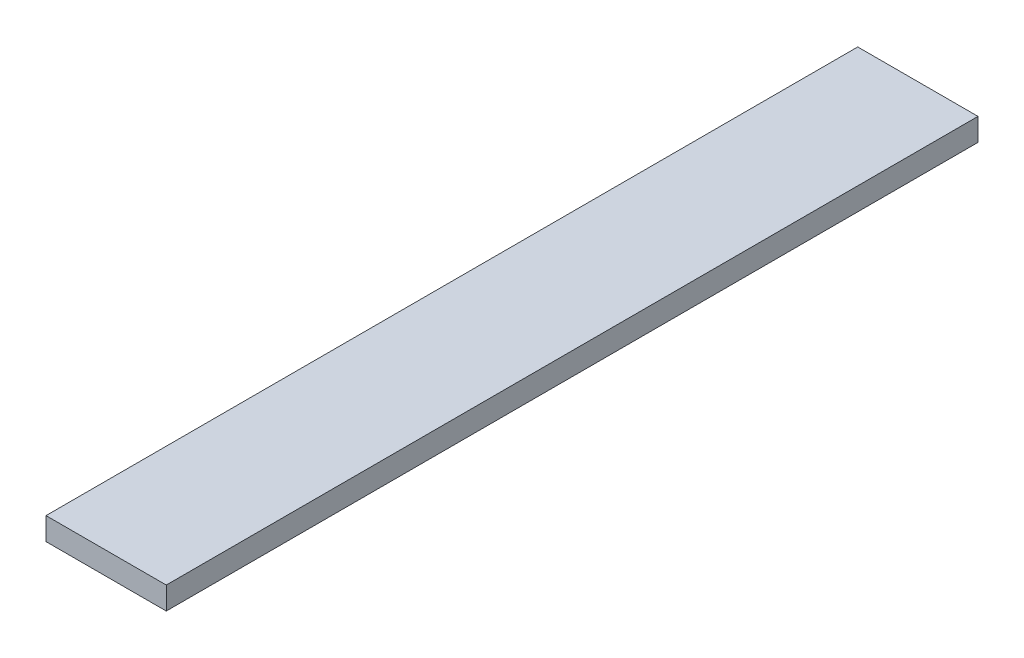
ISO-10303-21;
HEADER;
FILE_DESCRIPTION(('STEP AP214'),'2;1');
FILE_NAME('part.step','',(''),(''),'','','');
FILE_SCHEMA(('AUTOMOTIVE_DESIGN { 1 0 10303 214 1 1 1 1 }'));
ENDSEC;
DATA;
#1=APPLICATION_CONTEXT('core data for automotive mechanical design processes');
#2=APPLICATION_PROTOCOL_DEFINITION('international standard','automotive_design',2000,#1);
#3=PRODUCT_CONTEXT('',#1,'mechanical');
#4=PRODUCT('Part','Part','',(#3));
#5=PRODUCT_RELATED_PRODUCT_CATEGORY('part','',(#4));
#6=PRODUCT_DEFINITION_FORMATION('','',#4);
#7=PRODUCT_DEFINITION_CONTEXT('part definition',#1,'design');
#8=PRODUCT_DEFINITION('design','',#6,#7);
#9=PRODUCT_DEFINITION_SHAPE('','',#8);
#10=(LENGTH_UNIT() NAMED_UNIT(*) SI_UNIT(.MILLI.,.METRE.));
#11=(NAMED_UNIT(*) PLANE_ANGLE_UNIT() SI_UNIT($,.RADIAN.));
#12=(NAMED_UNIT(*) SI_UNIT($,.STERADIAN.) SOLID_ANGLE_UNIT());
#13=UNCERTAINTY_MEASURE_WITH_UNIT(LENGTH_MEASURE(1.E-05),#10,'distance_accuracy_value','');
#14=(GEOMETRIC_REPRESENTATION_CONTEXT(3) GLOBAL_UNCERTAINTY_ASSIGNED_CONTEXT((#13)) GLOBAL_UNIT_ASSIGNED_CONTEXT((#10,
#11,#12)) REPRESENTATION_CONTEXT('',''));
#15=CARTESIAN_POINT('',(0.,0.,0.));
#16=DIRECTION('',(0.,0.,1.));
#17=DIRECTION('',(1.,0.,0.));
#18=AXIS2_PLACEMENT_3D('',#15,#16,#17);
#19=CARTESIAN_POINT('',(50.7999999999999,19.05,-342.9));
#20=DIRECTION('',(-1.,0.,0.));
#21=DIRECTION('',(0.,0.,1.));
#22=AXIS2_PLACEMENT_3D('',#19,#20,#21);
#23=PLANE('',#22);
#24=DIRECTION('',(0.,0.,-1.));
#25=VECTOR('',#24,1.);
#26=CARTESIAN_POINT('',(50.7999999999999,0.,-342.9));
#27=LINE('',#26,#25);
#28=CARTESIAN_POINT('',(50.8,0.,342.9));
#29=VERTEX_POINT('',#28);
#30=CARTESIAN_POINT('',(50.7999999999999,0.,-342.9));
#31=VERTEX_POINT('',#30);
#32=EDGE_CURVE('E96',#29,#31,#27,.T.);
#33=ORIENTED_EDGE('',*,*,#32,.T.);
#34=DIRECTION('',(0.,-1.,0.));
#35=VECTOR('',#34,1.);
#36=CARTESIAN_POINT('',(50.7999999999999,19.05,-342.9));
#37=LINE('',#36,#35);
#38=CARTESIAN_POINT('',(50.7999999999999,19.05,-342.9));
#39=VERTEX_POINT('',#38);
#40=EDGE_CURVE('E11',#39,#31,#37,.T.);
#41=ORIENTED_EDGE('',*,*,#40,.F.);
#42=DIRECTION('',(0.,0.,-1.));
#43=VECTOR('',#42,1.);
#44=CARTESIAN_POINT('',(50.7999999999999,19.05,-342.9));
#45=LINE('',#44,#43);
#46=CARTESIAN_POINT('',(50.8,19.05,342.9));
#47=VERTEX_POINT('',#46);
#48=EDGE_CURVE('E84',#47,#39,#45,.T.);
#49=ORIENTED_EDGE('',*,*,#48,.F.);
#50=DIRECTION('',(0.,-1.,0.));
#51=VECTOR('',#50,1.);
#52=CARTESIAN_POINT('',(50.8,19.05,342.9));
#53=LINE('',#52,#51);
#54=EDGE_CURVE('E92',#47,#29,#53,.T.);
#55=ORIENTED_EDGE('',*,*,#54,.T.);
#56=EDGE_LOOP('',(#33,#41,#49,#55));
#57=FACE_BOUND('',#56,.T.);
#58=ADVANCED_FACE('F33',(#57),#23,.F.);
#59=CARTESIAN_POINT('',(-50.8,19.05,-342.9));
#60=DIRECTION('',(0.,0.,1.));
#61=DIRECTION('',(1.,0.,0.));
#62=AXIS2_PLACEMENT_3D('',#59,#60,#61);
#63=PLANE('',#62);
#64=DIRECTION('',(-1.,0.,0.));
#65=VECTOR('',#64,1.);
#66=CARTESIAN_POINT('',(-50.8,0.,-342.9));
#67=LINE('',#66,#65);
#68=CARTESIAN_POINT('',(-50.8,0.,-342.9));
#69=VERTEX_POINT('',#68);
#70=EDGE_CURVE('E88',#31,#69,#67,.T.);
#71=ORIENTED_EDGE('',*,*,#70,.T.);
#72=DIRECTION('',(0.,-1.,0.));
#73=VECTOR('',#72,1.);
#74=CARTESIAN_POINT('',(-50.8,19.05,-342.9));
#75=LINE('',#74,#73);
#76=CARTESIAN_POINT('',(-50.8,19.05,-342.9));
#77=VERTEX_POINT('',#76);
#78=EDGE_CURVE('E41',#77,#69,#75,.T.);
#79=ORIENTED_EDGE('',*,*,#78,.F.);
#80=DIRECTION('',(-1.,0.,0.));
#81=VECTOR('',#80,1.);
#82=CARTESIAN_POINT('',(-50.8,19.05,-342.9));
#83=LINE('',#82,#81);
#84=EDGE_CURVE('E79',#39,#77,#83,.T.);
#85=ORIENTED_EDGE('',*,*,#84,.F.);
#86=ORIENTED_EDGE('',*,*,#40,.T.);
#87=EDGE_LOOP('',(#71,#79,#85,#86));
#88=FACE_BOUND('',#87,.T.);
#89=ADVANCED_FACE('F87',(#88),#63,.F.);
#90=CARTESIAN_POINT('',(-50.8,19.05,-342.9));
#91=DIRECTION('',(1.,0.,0.));
#92=DIRECTION('',(0.,0.,-1.));
#93=AXIS2_PLACEMENT_3D('',#90,#91,#92);
#94=PLANE('',#93);
#95=DIRECTION('',(0.,0.,1.));
#96=VECTOR('',#95,1.);
#97=CARTESIAN_POINT('',(-50.8,0.,-342.9));
#98=LINE('',#97,#96);
#99=CARTESIAN_POINT('',(-50.8,0.,342.9));
#100=VERTEX_POINT('',#99);
#101=EDGE_CURVE('E66',#69,#100,#98,.T.);
#102=ORIENTED_EDGE('',*,*,#101,.T.);
#103=DIRECTION('',(0.,-1.,0.));
#104=VECTOR('',#103,1.);
#105=CARTESIAN_POINT('',(-50.8,19.05,342.9));
#106=LINE('',#105,#104);
#107=CARTESIAN_POINT('',(-50.8,19.05,342.9));
#108=VERTEX_POINT('',#107);
#109=EDGE_CURVE('E89',#108,#100,#106,.T.);
#110=ORIENTED_EDGE('',*,*,#109,.F.);
#111=DIRECTION('',(0.,0.,1.));
#112=VECTOR('',#111,1.);
#113=CARTESIAN_POINT('',(-50.8,19.05,-342.9));
#114=LINE('',#113,#112);
#115=EDGE_CURVE('E82',#77,#108,#114,.T.);
#116=ORIENTED_EDGE('',*,*,#115,.F.);
#117=ORIENTED_EDGE('',*,*,#78,.T.);
#118=EDGE_LOOP('',(#102,#110,#116,#117));
#119=FACE_BOUND('',#118,.T.);
#120=ADVANCED_FACE('F90',(#119),#94,.F.);
#121=CARTESIAN_POINT('',(-50.8,19.05,342.9));
#122=DIRECTION('',(0.,0.,-1.));
#123=DIRECTION('',(-1.,0.,0.));
#124=AXIS2_PLACEMENT_3D('',#121,#122,#123);
#125=PLANE('',#124);
#126=DIRECTION('',(1.,0.,0.));
#127=VECTOR('',#126,1.);
#128=CARTESIAN_POINT('',(-50.8,0.,342.9));
#129=LINE('',#128,#127);
#130=EDGE_CURVE('E72',#100,#29,#129,.T.);
#131=ORIENTED_EDGE('',*,*,#130,.T.);
#132=ORIENTED_EDGE('',*,*,#54,.F.);
#133=DIRECTION('',(1.,0.,0.));
#134=VECTOR('',#133,1.);
#135=CARTESIAN_POINT('',(-50.8,19.05,342.9));
#136=LINE('',#135,#134);
#137=EDGE_CURVE('E49',#108,#47,#136,.T.);
#138=ORIENTED_EDGE('',*,*,#137,.F.);
#139=ORIENTED_EDGE('',*,*,#109,.T.);
#140=EDGE_LOOP('',(#131,#132,#138,#139));
#141=FACE_BOUND('',#140,.T.);
#142=ADVANCED_FACE('F103',(#141),#125,.F.);
#143=CARTESIAN_POINT('',(50.8,19.05,342.9));
#144=DIRECTION('',(0.,1.,0.));
#145=DIRECTION('',(0.,0.,1.));
#146=AXIS2_PLACEMENT_3D('',#143,#144,#145);
#147=PLANE('',#146);
#148=ORIENTED_EDGE('',*,*,#48,.T.);
#149=ORIENTED_EDGE('',*,*,#84,.T.);
#150=ORIENTED_EDGE('',*,*,#115,.T.);
#151=ORIENTED_EDGE('',*,*,#137,.T.);
#152=EDGE_LOOP('',(#148,#149,#150,#151));
#153=FACE_BOUND('',#152,.T.);
#154=ADVANCED_FACE('F80',(#153),#147,.T.);
#155=CARTESIAN_POINT('',(50.8,0.,342.9));
#156=DIRECTION('',(0.,1.,0.));
#157=DIRECTION('',(0.,0.,1.));
#158=AXIS2_PLACEMENT_3D('',#155,#156,#157);
#159=PLANE('',#158);
#160=ORIENTED_EDGE('',*,*,#32,.F.);
#161=ORIENTED_EDGE('',*,*,#130,.F.);
#162=ORIENTED_EDGE('',*,*,#101,.F.);
#163=ORIENTED_EDGE('',*,*,#70,.F.);
#164=EDGE_LOOP('',(#160,#161,#162,#163));
#165=FACE_BOUND('',#164,.T.);
#166=ADVANCED_FACE('F106',(#165),#159,.F.);
#167=CLOSED_SHELL('',(#58,#89,#120,#142,#154,#166));
#168=MANIFOLD_SOLID_BREP('B2',#167);
#169=ADVANCED_BREP_SHAPE_REPRESENTATION('',(#18,#168),#14);
#170=SHAPE_DEFINITION_REPRESENTATION(#9,#169);
ENDSEC;
END-ISO-10303-21;
